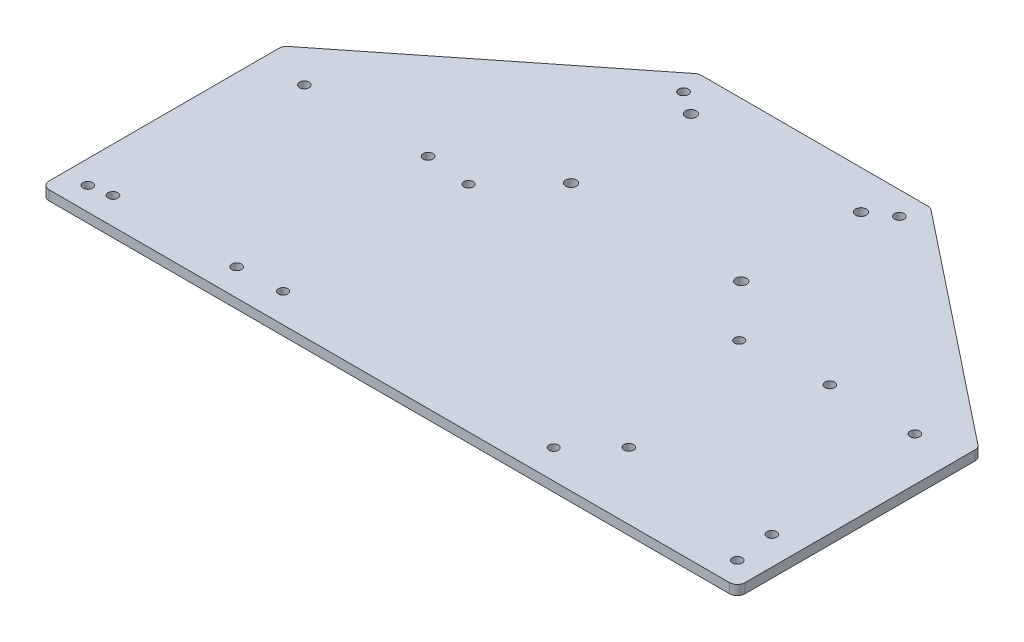
ISO-10303-21;
HEADER;
FILE_DESCRIPTION(('STEP AP214'),'2;1');
FILE_NAME('part.step','',(''),(''),'','','');
FILE_SCHEMA(('AUTOMOTIVE_DESIGN { 1 0 10303 214 1 1 1 1 }'));
ENDSEC;
DATA;
#1=APPLICATION_CONTEXT('core data for automotive mechanical design processes');
#2=APPLICATION_PROTOCOL_DEFINITION('international standard','automotive_design',2000,#1);
#3=PRODUCT_CONTEXT('',#1,'mechanical');
#4=PRODUCT('Part','Part','',(#3));
#5=PRODUCT_RELATED_PRODUCT_CATEGORY('part','',(#4));
#6=PRODUCT_DEFINITION_FORMATION('','',#4);
#7=PRODUCT_DEFINITION_CONTEXT('part definition',#1,'design');
#8=PRODUCT_DEFINITION('design','',#6,#7);
#9=PRODUCT_DEFINITION_SHAPE('','',#8);
#10=(LENGTH_UNIT() NAMED_UNIT(*) SI_UNIT(.MILLI.,.METRE.));
#11=(NAMED_UNIT(*) PLANE_ANGLE_UNIT() SI_UNIT($,.RADIAN.));
#12=(NAMED_UNIT(*) SI_UNIT($,.STERADIAN.) SOLID_ANGLE_UNIT());
#13=UNCERTAINTY_MEASURE_WITH_UNIT(LENGTH_MEASURE(1.E-05),#10,'distance_accuracy_value','');
#14=(GEOMETRIC_REPRESENTATION_CONTEXT(3) GLOBAL_UNCERTAINTY_ASSIGNED_CONTEXT((#13)) GLOBAL_UNIT_ASSIGNED_CONTEXT((#10,
#11,#12)) REPRESENTATION_CONTEXT('',''));
#15=CARTESIAN_POINT('',(0.,0.,0.));
#16=DIRECTION('',(0.,0.,1.));
#17=DIRECTION('',(1.,0.,0.));
#18=AXIS2_PLACEMENT_3D('',#15,#16,#17);
#19=CARTESIAN_POINT('',(0.,3.175,0.));
#20=DIRECTION('',(0.,-1.,0.));
#21=DIRECTION('',(0.,0.,-1.));
#22=AXIS2_PLACEMENT_3D('',#19,#20,#21);
#23=PLANE('',#22);
#24=CARTESIAN_POINT('',(7.62000000000002,3.175,-7.61999999999994));
#25=DIRECTION('',(0.,-1.,0.));
#26=DIRECTION('',(0.,0.,-1.));
#27=AXIS2_PLACEMENT_3D('',#24,#25,#26);
#28=CIRCLE('',#27,1.58749999999999);
#29=CARTESIAN_POINT('',(7.62000000000002,3.175,-9.20749999999993));
#30=VERTEX_POINT('',#29);
#31=EDGE_CURVE('E349',#30,#30,#28,.T.);
#32=ORIENTED_EDGE('',*,*,#31,.T.);
#33=EDGE_LOOP('',(#32));
#34=FACE_BOUND('',#33,.T.);
#35=CARTESIAN_POINT('',(149.744486069191,3.175,-132.08));
#36=DIRECTION('',(0.,1.,0.));
#37=DIRECTION('',(0.,0.,1.));
#38=AXIS2_PLACEMENT_3D('',#35,#36,#37);
#39=CIRCLE('',#38,1.58749999999999);
#40=CARTESIAN_POINT('',(149.744486069191,3.175,-130.4925));
#41=VERTEX_POINT('',#40);
#42=EDGE_CURVE('E344',#41,#41,#39,.T.);
#43=ORIENTED_EDGE('',*,*,#42,.F.);
#44=EDGE_LOOP('',(#43));
#45=FACE_BOUND('',#44,.T.);
#46=CARTESIAN_POINT('',(78.8555139308093,3.175,-132.08));
#47=DIRECTION('',(0.,-1.,0.));
#48=DIRECTION('',(0.,0.,-1.));
#49=AXIS2_PLACEMENT_3D('',#46,#47,#48);
#50=CIRCLE('',#49,1.58749999999999);
#51=CARTESIAN_POINT('',(78.8555139308093,3.175,-133.6675));
#52=VERTEX_POINT('',#51);
#53=EDGE_CURVE('E154',#52,#52,#50,.T.);
#54=ORIENTED_EDGE('',*,*,#53,.T.);
#55=EDGE_LOOP('',(#54));
#56=FACE_BOUND('',#55,.T.);
#57=CARTESIAN_POINT('',(14.605,3.175,-8.89));
#58=DIRECTION('',(0.,1.,0.));
#59=DIRECTION('',(0.,0.,1.));
#60=AXIS2_PLACEMENT_3D('',#57,#58,#59);
#61=CIRCLE('',#60,1.5875);
#62=CARTESIAN_POINT('',(14.605,3.175,-7.3025));
#63=VERTEX_POINT('',#62);
#64=EDGE_CURVE('E171',#63,#63,#61,.T.);
#65=ORIENTED_EDGE('',*,*,#64,.F.);
#66=EDGE_LOOP('',(#65));
#67=FACE_BOUND('',#66,.T.);
#68=CARTESIAN_POINT('',(55.245,3.175,-71.755));
#69=DIRECTION('',(0.,1.,0.));
#70=DIRECTION('',(0.,0.,1.));
#71=AXIS2_PLACEMENT_3D('',#68,#69,#70);
#72=CIRCLE('',#71,1.5875);
#73=CARTESIAN_POINT('',(55.245,3.175,-70.1675));
#74=VERTEX_POINT('',#73);
#75=EDGE_CURVE('E165',#74,#74,#72,.T.);
#76=ORIENTED_EDGE('',*,*,#75,.F.);
#77=EDGE_LOOP('',(#76));
#78=FACE_BOUND('',#77,.T.);
#79=CARTESIAN_POINT('',(55.245,3.175,-8.89));
#80=DIRECTION('',(0.,1.,0.));
#81=DIRECTION('',(0.,0.,1.));
#82=AXIS2_PLACEMENT_3D('',#79,#80,#81);
#83=CIRCLE('',#82,1.5875);
#84=CARTESIAN_POINT('',(55.245,3.175,-7.3025));
#85=VERTEX_POINT('',#84);
#86=EDGE_CURVE('E158',#85,#85,#83,.T.);
#87=ORIENTED_EDGE('',*,*,#86,.F.);
#88=EDGE_LOOP('',(#87));
#89=FACE_BOUND('',#88,.T.);
#90=CARTESIAN_POINT('',(14.605,3.175,-71.755));
#91=DIRECTION('',(0.,1.,0.));
#92=DIRECTION('',(0.,0.,1.));
#93=AXIS2_PLACEMENT_3D('',#90,#91,#92);
#94=CIRCLE('',#93,1.5875);
#95=CARTESIAN_POINT('',(14.605,3.175,-70.1675));
#96=VERTEX_POINT('',#95);
#97=EDGE_CURVE('E161',#96,#96,#94,.T.);
#98=ORIENTED_EDGE('',*,*,#97,.F.);
#99=EDGE_LOOP('',(#98));
#100=FACE_BOUND('',#99,.T.);
#101=CARTESIAN_POINT('',(219.2782,3.175,-20.67814));
#102=DIRECTION('',(0.,1.,0.));
#103=DIRECTION('',(0.,0.,1.));
#104=AXIS2_PLACEMENT_3D('',#101,#102,#103);
#105=CIRCLE('',#104,1.58750000000001);
#106=CARTESIAN_POINT('',(219.2782,3.175,-19.09064));
#107=VERTEX_POINT('',#106);
#108=EDGE_CURVE('E197',#107,#107,#105,.T.);
#109=ORIENTED_EDGE('',*,*,#108,.F.);
#110=EDGE_LOOP('',(#109));
#111=FACE_BOUND('',#110,.T.);
#112=CARTESIAN_POINT('',(171.0182,3.175,-21.94814));
#113=DIRECTION('',(0.,1.,0.));
#114=DIRECTION('',(0.,0.,1.));
#115=AXIS2_PLACEMENT_3D('',#112,#113,#114);
#116=CIRCLE('',#115,1.58749999999999);
#117=CARTESIAN_POINT('',(171.0182,3.175,-20.36064));
#118=VERTEX_POINT('',#117);
#119=EDGE_CURVE('E191',#118,#118,#116,.T.);
#120=ORIENTED_EDGE('',*,*,#119,.F.);
#121=EDGE_LOOP('',(#120));
#122=FACE_BOUND('',#121,.T.);
#123=CARTESIAN_POINT('',(214.1982,3.175,-72.74814));
#124=DIRECTION('',(0.,1.,0.));
#125=DIRECTION('',(0.,0.,1.));
#126=AXIS2_PLACEMENT_3D('',#123,#124,#125);
#127=CIRCLE('',#126,1.58749999999999);
#128=CARTESIAN_POINT('',(214.1982,3.175,-71.16064));
#129=VERTEX_POINT('',#128);
#130=EDGE_CURVE('E184',#129,#129,#127,.T.);
#131=ORIENTED_EDGE('',*,*,#130,.F.);
#132=EDGE_LOOP('',(#131));
#133=FACE_BOUND('',#132,.T.);
#134=CARTESIAN_POINT('',(186.2582,3.175,-72.74814));
#135=DIRECTION('',(0.,1.,0.));
#136=DIRECTION('',(0.,0.,1.));
#137=AXIS2_PLACEMENT_3D('',#134,#135,#136);
#138=CIRCLE('',#137,1.58749999999999);
#139=CARTESIAN_POINT('',(186.2582,3.175,-71.16064));
#140=VERTEX_POINT('',#139);
#141=EDGE_CURVE('E187',#140,#140,#138,.T.);
#142=ORIENTED_EDGE('',*,*,#141,.F.);
#143=EDGE_LOOP('',(#142));
#144=FACE_BOUND('',#143,.T.);
#145=CARTESIAN_POINT('',(69.85,3.175,-9.525));
#146=DIRECTION('',(0.,1.,0.));
#147=DIRECTION('',(0.,0.,1.));
#148=AXIS2_PLACEMENT_3D('',#145,#146,#147);
#149=CIRCLE('',#148,1.52399999999999);
#150=CARTESIAN_POINT('',(69.85,3.175,-8.00100000000001));
#151=VERTEX_POINT('',#150);
#152=EDGE_CURVE('E221',#151,#151,#149,.T.);
#153=ORIENTED_EDGE('',*,*,#152,.F.);
#154=EDGE_LOOP('',(#153));
#155=FACE_BOUND('',#154,.T.);
#156=CARTESIAN_POINT('',(158.75,3.175,-9.525));
#157=DIRECTION('',(0.,1.,0.));
#158=DIRECTION('',(0.,0.,1.));
#159=AXIS2_PLACEMENT_3D('',#156,#157,#158);
#160=CIRCLE('',#159,1.52400000000001);
#161=CARTESIAN_POINT('',(158.75,3.175,-8.00099999999999));
#162=VERTEX_POINT('',#161);
#163=EDGE_CURVE('E215',#162,#162,#160,.T.);
#164=ORIENTED_EDGE('',*,*,#163,.F.);
#165=EDGE_LOOP('',(#164));
#166=FACE_BOUND('',#165,.T.);
#167=CARTESIAN_POINT('',(158.75,3.175,-70.485));
#168=DIRECTION('',(0.,1.,0.));
#169=DIRECTION('',(0.,0.,1.));
#170=AXIS2_PLACEMENT_3D('',#167,#168,#169);
#171=CIRCLE('',#170,1.52400000000001);
#172=CARTESIAN_POINT('',(158.75,3.175,-68.961));
#173=VERTEX_POINT('',#172);
#174=EDGE_CURVE('E208',#173,#173,#171,.T.);
#175=ORIENTED_EDGE('',*,*,#174,.F.);
#176=EDGE_LOOP('',(#175));
#177=FACE_BOUND('',#176,.T.);
#178=CARTESIAN_POINT('',(69.85,3.175,-70.485));
#179=DIRECTION('',(0.,1.,0.));
#180=DIRECTION('',(0.,0.,1.));
#181=AXIS2_PLACEMENT_3D('',#178,#179,#180);
#182=CIRCLE('',#181,1.52399999999999);
#183=CARTESIAN_POINT('',(69.85,3.175,-68.961));
#184=VERTEX_POINT('',#183);
#185=EDGE_CURVE('E211',#184,#184,#182,.T.);
#186=ORIENTED_EDGE('',*,*,#185,.F.);
#187=EDGE_LOOP('',(#186));
#188=FACE_BOUND('',#187,.T.);
#189=DIRECTION('',(0.783409990366249,0.,-0.621505259023891));
#190=VECTOR('',#189,1.);
#191=CARTESIAN_POINT('',(0.,3.175,-79.248));
#192=LINE('',#191,#190);
#193=CARTESIAN_POINT('',(0.961376642079324,3.175,-80.0106921360496));
#194=VERTEX_POINT('',#193);
#195=CARTESIAN_POINT('',(75.5065479523491,3.175,-139.14986137553));
#196=VERTEX_POINT('',#195);
#197=EDGE_CURVE('E141',#194,#196,#192,.T.);
#198=ORIENTED_EDGE('',*,*,#197,.F.);
#199=CARTESIAN_POINT('',(2.54,3.175,-78.0208307605193));
#200=DIRECTION('',(0.,-1.,0.));
#201=DIRECTION('',(0.,0.,-1.));
#202=AXIS2_PLACEMENT_3D('',#199,#200,#201);
#203=CIRCLE('',#202,2.54);
#204=CARTESIAN_POINT('',(0.,3.175,-78.0208307605193));
#205=VERTEX_POINT('',#204);
#206=EDGE_CURVE('E124',#194,#205,#203,.F.);
#207=ORIENTED_EDGE('',*,*,#206,.T.);
#208=DIRECTION('',(0.,0.,1.));
#209=VECTOR('',#208,1.);
#210=CARTESIAN_POINT('',(0.,3.175,0.));
#211=LINE('',#210,#209);
#212=CARTESIAN_POINT('',(0.,3.175,-2.54));
#213=VERTEX_POINT('',#212);
#214=EDGE_CURVE('E256',#205,#213,#211,.T.);
#215=ORIENTED_EDGE('',*,*,#214,.T.);
#216=CARTESIAN_POINT('',(2.54,3.175,-2.54));
#217=DIRECTION('',(0.,-1.,0.));
#218=DIRECTION('',(0.,0.,-1.));
#219=AXIS2_PLACEMENT_3D('',#216,#217,#218);
#220=CIRCLE('',#219,2.54);
#221=CARTESIAN_POINT('',(2.54,3.175,0.));
#222=VERTEX_POINT('',#221);
#223=EDGE_CURVE('E278',#213,#222,#220,.F.);
#224=ORIENTED_EDGE('',*,*,#223,.T.);
#225=DIRECTION('',(1.,0.,0.));
#226=VECTOR('',#225,1.);
#227=CARTESIAN_POINT('',(0.,3.175,0.));
#228=LINE('',#227,#226);
#229=CARTESIAN_POINT('',(226.06,3.175,0.));
#230=VERTEX_POINT('',#229);
#231=EDGE_CURVE('E258',#222,#230,#228,.T.);
#232=ORIENTED_EDGE('',*,*,#231,.T.);
#233=CARTESIAN_POINT('',(226.06,3.175,-2.54));
#234=DIRECTION('',(0.,-1.,0.));
#235=DIRECTION('',(0.,0.,-1.));
#236=AXIS2_PLACEMENT_3D('',#233,#234,#235);
#237=CIRCLE('',#236,2.54);
#238=CARTESIAN_POINT('',(228.6,3.175,-2.54));
#239=VERTEX_POINT('',#238);
#240=EDGE_CURVE('E144',#230,#239,#237,.F.);
#241=ORIENTED_EDGE('',*,*,#240,.T.);
#242=DIRECTION('',(0.,0.,-1.));
#243=VECTOR('',#242,1.);
#244=CARTESIAN_POINT('',(228.6,3.175,0.));
#245=LINE('',#244,#243);
#246=CARTESIAN_POINT('',(228.6,3.175,-78.0208307605193));
#247=VERTEX_POINT('',#246);
#248=EDGE_CURVE('E262',#239,#247,#245,.T.);
#249=ORIENTED_EDGE('',*,*,#248,.T.);
#250=CARTESIAN_POINT('',(226.06,3.175,-78.0208307605193));
#251=DIRECTION('',(0.,-1.,0.));
#252=DIRECTION('',(0.,0.,-1.));
#253=AXIS2_PLACEMENT_3D('',#250,#251,#252);
#254=CIRCLE('',#253,2.54);
#255=CARTESIAN_POINT('',(227.638623357921,3.175,-80.0106921360496));
#256=VERTEX_POINT('',#255);
#257=EDGE_CURVE('E280',#247,#256,#254,.F.);
#258=ORIENTED_EDGE('',*,*,#257,.T.);
#259=DIRECTION('',(0.783409990366249,0.,0.621505259023891));
#260=VECTOR('',#259,1.);
#261=CARTESIAN_POINT('',(228.6,3.175,-79.248));
#262=LINE('',#261,#260);
#263=CARTESIAN_POINT('',(153.093452047651,3.175,-139.14986137553));
#264=VERTEX_POINT('',#263);
#265=EDGE_CURVE('E151',#264,#256,#262,.T.);
#266=ORIENTED_EDGE('',*,*,#265,.F.);
#267=CARTESIAN_POINT('',(151.51482868973,3.175,-137.16));
#268=DIRECTION('',(0.,-1.,0.));
#269=DIRECTION('',(0.,0.,-1.));
#270=AXIS2_PLACEMENT_3D('',#267,#268,#269);
#271=CIRCLE('',#270,2.54);
#272=CARTESIAN_POINT('',(151.51482868973,3.175,-139.7));
#273=VERTEX_POINT('',#272);
#274=EDGE_CURVE('E282',#264,#273,#271,.F.);
#275=ORIENTED_EDGE('',*,*,#274,.T.);
#276=DIRECTION('',(-1.,0.,0.));
#277=VECTOR('',#276,1.);
#278=CARTESIAN_POINT('',(0.,3.175,-139.7));
#279=LINE('',#278,#277);
#280=CARTESIAN_POINT('',(77.0851713102698,3.175,-139.7));
#281=VERTEX_POINT('',#280);
#282=EDGE_CURVE('E265',#273,#281,#279,.T.);
#283=ORIENTED_EDGE('',*,*,#282,.T.);
#284=CARTESIAN_POINT('',(77.0851713102698,3.175,-137.16));
#285=DIRECTION('',(0.,-1.,0.));
#286=DIRECTION('',(0.,0.,-1.));
#287=AXIS2_PLACEMENT_3D('',#284,#285,#286);
#288=CIRCLE('',#287,2.54);
#289=EDGE_CURVE('E135',#281,#196,#288,.F.);
#290=ORIENTED_EDGE('',*,*,#289,.T.);
#291=EDGE_LOOP('',(#198,#207,#215,#224,#232,#241,#249,#258,#266,#275,#283,#290));
#292=FACE_BOUND('',#291,.T.);
#293=CARTESIAN_POINT('',(86.36,3.175,-127.));
#294=DIRECTION('',(0.,1.,0.));
#295=DIRECTION('',(0.,0.,1.));
#296=AXIS2_PLACEMENT_3D('',#293,#294,#295);
#297=CIRCLE('',#296,1.778);
#298=CARTESIAN_POINT('',(86.36,3.175,-125.222));
#299=VERTEX_POINT('',#298);
#300=EDGE_CURVE('E250',#299,#299,#297,.T.);
#301=ORIENTED_EDGE('',*,*,#300,.F.);
#302=EDGE_LOOP('',(#301));
#303=FACE_BOUND('',#302,.T.);
#304=CARTESIAN_POINT('',(142.24,3.175,-127.));
#305=DIRECTION('',(0.,1.,0.));
#306=DIRECTION('',(0.,0.,1.));
#307=AXIS2_PLACEMENT_3D('',#304,#305,#306);
#308=CIRCLE('',#307,1.778);
#309=CARTESIAN_POINT('',(142.24,3.175,-125.222));
#310=VERTEX_POINT('',#309);
#311=EDGE_CURVE('E244',#310,#310,#308,.T.);
#312=ORIENTED_EDGE('',*,*,#311,.F.);
#313=EDGE_LOOP('',(#312));
#314=FACE_BOUND('',#313,.T.);
#315=CARTESIAN_POINT('',(86.36,3.175,-87.63));
#316=DIRECTION('',(0.,1.,0.));
#317=DIRECTION('',(0.,0.,1.));
#318=AXIS2_PLACEMENT_3D('',#315,#316,#317);
#319=CIRCLE('',#318,1.778);
#320=CARTESIAN_POINT('',(86.36,3.175,-85.852));
#321=VERTEX_POINT('',#320);
#322=EDGE_CURVE('E238',#321,#321,#319,.T.);
#323=ORIENTED_EDGE('',*,*,#322,.F.);
#324=EDGE_LOOP('',(#323));
#325=FACE_BOUND('',#324,.T.);
#326=CARTESIAN_POINT('',(142.24,3.175,-87.63));
#327=DIRECTION('',(0.,1.,0.));
#328=DIRECTION('',(0.,0.,1.));
#329=AXIS2_PLACEMENT_3D('',#326,#327,#328);
#330=CIRCLE('',#329,1.778);
#331=CARTESIAN_POINT('',(142.24,3.175,-85.852));
#332=VERTEX_POINT('',#331);
#333=EDGE_CURVE('E232',#332,#332,#330,.T.);
#334=ORIENTED_EDGE('',*,*,#333,.F.);
#335=EDGE_LOOP('',(#334));
#336=FACE_BOUND('',#335,.T.);
#337=CARTESIAN_POINT('',(220.98,3.175,-7.62));
#338=DIRECTION('',(0.,1.,0.));
#339=DIRECTION('',(0.,0.,1.));
#340=AXIS2_PLACEMENT_3D('',#337,#338,#339);
#341=CIRCLE('',#340,1.58749999999999);
#342=CARTESIAN_POINT('',(220.98,3.175,-6.03250000000001));
#343=VERTEX_POINT('',#342);
#344=EDGE_CURVE('E355',#343,#343,#341,.T.);
#345=ORIENTED_EDGE('',*,*,#344,.F.);
#346=EDGE_LOOP('',(#345));
#347=FACE_BOUND('',#346,.T.);
#348=ADVANCED_FACE('F33',(#34,#45,#56,#67,#78,#89,#100,#111,#122,#133,#144,#155,#166,#177,#188,
#292,#303,#314,#325,#336,#347),#23,.F.);
#349=CARTESIAN_POINT('',(0.,0.,0.));
#350=DIRECTION('',(0.,-1.,0.));
#351=DIRECTION('',(0.,0.,-1.));
#352=AXIS2_PLACEMENT_3D('',#349,#350,#351);
#353=PLANE('',#352);
#354=CARTESIAN_POINT('',(7.62000000000002,0.,-7.61999999999994));
#355=DIRECTION('',(0.,-1.,0.));
#356=DIRECTION('',(0.,0.,-1.));
#357=AXIS2_PLACEMENT_3D('',#354,#355,#356);
#358=CIRCLE('',#357,1.58749999999999);
#359=CARTESIAN_POINT('',(7.62000000000002,0.,-9.20749999999993));
#360=VERTEX_POINT('',#359);
#361=EDGE_CURVE('E346',#360,#360,#358,.T.);
#362=ORIENTED_EDGE('',*,*,#361,.F.);
#363=EDGE_LOOP('',(#362));
#364=FACE_BOUND('',#363,.T.);
#365=CARTESIAN_POINT('',(78.8555139308093,0.,-132.08));
#366=DIRECTION('',(0.,-1.,0.));
#367=DIRECTION('',(0.,0.,-1.));
#368=AXIS2_PLACEMENT_3D('',#365,#366,#367);
#369=CIRCLE('',#368,1.58749999999999);
#370=CARTESIAN_POINT('',(78.8555139308093,0.,-133.6675));
#371=VERTEX_POINT('',#370);
#372=EDGE_CURVE('E149',#371,#371,#369,.T.);
#373=ORIENTED_EDGE('',*,*,#372,.F.);
#374=EDGE_LOOP('',(#373));
#375=FACE_BOUND('',#374,.T.);
#376=DIRECTION('',(0.,0.,1.));
#377=VECTOR('',#376,1.);
#378=CARTESIAN_POINT('',(0.,0.,0.));
#379=LINE('',#378,#377);
#380=CARTESIAN_POINT('',(0.,0.,-78.0208307605193));
#381=VERTEX_POINT('',#380);
#382=CARTESIAN_POINT('',(0.,0.,-2.54));
#383=VERTEX_POINT('',#382);
#384=EDGE_CURVE('E253',#381,#383,#379,.T.);
#385=ORIENTED_EDGE('',*,*,#384,.F.);
#386=CARTESIAN_POINT('',(2.54,0.,-78.0208307605193));
#387=DIRECTION('',(0.,-1.,0.));
#388=DIRECTION('',(0.,0.,-1.));
#389=AXIS2_PLACEMENT_3D('',#386,#387,#388);
#390=CIRCLE('',#389,2.54);
#391=CARTESIAN_POINT('',(0.961376642079324,0.,-80.0106921360496));
#392=VERTEX_POINT('',#391);
#393=EDGE_CURVE('E296',#381,#392,#390,.T.);
#394=ORIENTED_EDGE('',*,*,#393,.T.);
#395=DIRECTION('',(0.783409990366249,0.,-0.621505259023891));
#396=VECTOR('',#395,1.);
#397=CARTESIAN_POINT('',(0.,0.,-79.248));
#398=LINE('',#397,#396);
#399=CARTESIAN_POINT('',(75.5065479523491,0.,-139.14986137553));
#400=VERTEX_POINT('',#399);
#401=EDGE_CURVE('E143',#392,#400,#398,.T.);
#402=ORIENTED_EDGE('',*,*,#401,.T.);
#403=CARTESIAN_POINT('',(77.0851713102698,0.,-137.16));
#404=DIRECTION('',(0.,-1.,0.));
#405=DIRECTION('',(0.,0.,-1.));
#406=AXIS2_PLACEMENT_3D('',#403,#404,#405);
#407=CIRCLE('',#406,2.54);
#408=CARTESIAN_POINT('',(77.0851713102698,0.,-139.7));
#409=VERTEX_POINT('',#408);
#410=EDGE_CURVE('E48',#400,#409,#407,.T.);
#411=ORIENTED_EDGE('',*,*,#410,.T.);
#412=DIRECTION('',(-1.,0.,0.));
#413=VECTOR('',#412,1.);
#414=CARTESIAN_POINT('',(0.,0.,-139.7));
#415=LINE('',#414,#413);
#416=CARTESIAN_POINT('',(151.51482868973,0.,-139.7));
#417=VERTEX_POINT('',#416);
#418=EDGE_CURVE('E259',#417,#409,#415,.T.);
#419=ORIENTED_EDGE('',*,*,#418,.F.);
#420=CARTESIAN_POINT('',(151.51482868973,0.,-137.16));
#421=DIRECTION('',(0.,-1.,0.));
#422=DIRECTION('',(0.,0.,-1.));
#423=AXIS2_PLACEMENT_3D('',#420,#421,#422);
#424=CIRCLE('',#423,2.54);
#425=CARTESIAN_POINT('',(153.093452047651,0.,-139.14986137553));
#426=VERTEX_POINT('',#425);
#427=EDGE_CURVE('E293',#417,#426,#424,.T.);
#428=ORIENTED_EDGE('',*,*,#427,.T.);
#429=DIRECTION('',(0.783409990366249,0.,0.621505259023891));
#430=VECTOR('',#429,1.);
#431=CARTESIAN_POINT('',(228.6,0.,-79.248));
#432=LINE('',#431,#430);
#433=CARTESIAN_POINT('',(227.638623357921,0.,-80.0106921360496));
#434=VERTEX_POINT('',#433);
#435=EDGE_CURVE('E177',#426,#434,#432,.T.);
#436=ORIENTED_EDGE('',*,*,#435,.T.);
#437=CARTESIAN_POINT('',(226.06,0.,-78.0208307605193));
#438=DIRECTION('',(0.,-1.,0.));
#439=DIRECTION('',(0.,0.,-1.));
#440=AXIS2_PLACEMENT_3D('',#437,#438,#439);
#441=CIRCLE('',#440,2.54);
#442=CARTESIAN_POINT('',(228.6,0.,-78.0208307605193));
#443=VERTEX_POINT('',#442);
#444=EDGE_CURVE('E291',#434,#443,#441,.T.);
#445=ORIENTED_EDGE('',*,*,#444,.T.);
#446=DIRECTION('',(0.,0.,-1.));
#447=VECTOR('',#446,1.);
#448=CARTESIAN_POINT('',(228.6,0.,0.));
#449=LINE('',#448,#447);
#450=CARTESIAN_POINT('',(228.6,0.,-2.54));
#451=VERTEX_POINT('',#450);
#452=EDGE_CURVE('E272',#451,#443,#449,.T.);
#453=ORIENTED_EDGE('',*,*,#452,.F.);
#454=CARTESIAN_POINT('',(226.06,0.,-2.54));
#455=DIRECTION('',(0.,-1.,0.));
#456=DIRECTION('',(0.,0.,-1.));
#457=AXIS2_PLACEMENT_3D('',#454,#455,#456);
#458=CIRCLE('',#457,2.54);
#459=CARTESIAN_POINT('',(226.06,0.,0.));
#460=VERTEX_POINT('',#459);
#461=EDGE_CURVE('E287',#451,#460,#458,.T.);
#462=ORIENTED_EDGE('',*,*,#461,.T.);
#463=DIRECTION('',(1.,0.,0.));
#464=VECTOR('',#463,1.);
#465=CARTESIAN_POINT('',(0.,0.,0.));
#466=LINE('',#465,#464);
#467=CARTESIAN_POINT('',(2.54,0.,0.));
#468=VERTEX_POINT('',#467);
#469=EDGE_CURVE('E269',#468,#460,#466,.T.);
#470=ORIENTED_EDGE('',*,*,#469,.F.);
#471=CARTESIAN_POINT('',(2.54,0.,-2.54));
#472=DIRECTION('',(0.,-1.,0.));
#473=DIRECTION('',(0.,0.,-1.));
#474=AXIS2_PLACEMENT_3D('',#471,#472,#473);
#475=CIRCLE('',#474,2.54);
#476=EDGE_CURVE('E289',#468,#383,#475,.T.);
#477=ORIENTED_EDGE('',*,*,#476,.T.);
#478=EDGE_LOOP('',(#385,#394,#402,#411,#419,#428,#436,#445,#453,#462,#470,#477));
#479=FACE_BOUND('',#478,.T.);
#480=CARTESIAN_POINT('',(14.605,0.,-8.89));
#481=DIRECTION('',(0.,1.,0.));
#482=DIRECTION('',(0.,0.,1.));
#483=AXIS2_PLACEMENT_3D('',#480,#481,#482);
#484=CIRCLE('',#483,1.5875);
#485=CARTESIAN_POINT('',(14.605,0.,-7.3025));
#486=VERTEX_POINT('',#485);
#487=EDGE_CURVE('E174',#486,#486,#484,.T.);
#488=ORIENTED_EDGE('',*,*,#487,.T.);
#489=EDGE_LOOP('',(#488));
#490=FACE_BOUND('',#489,.T.);
#491=CARTESIAN_POINT('',(55.245,0.,-71.755));
#492=DIRECTION('',(0.,1.,0.));
#493=DIRECTION('',(0.,0.,1.));
#494=AXIS2_PLACEMENT_3D('',#491,#492,#493);
#495=CIRCLE('',#494,1.5875);
#496=CARTESIAN_POINT('',(55.245,0.,-70.1675));
#497=VERTEX_POINT('',#496);
#498=EDGE_CURVE('E168',#497,#497,#495,.T.);
#499=ORIENTED_EDGE('',*,*,#498,.T.);
#500=EDGE_LOOP('',(#499));
#501=FACE_BOUND('',#500,.T.);
#502=CARTESIAN_POINT('',(55.245,0.,-8.89));
#503=DIRECTION('',(0.,1.,0.));
#504=DIRECTION('',(0.,0.,1.));
#505=AXIS2_PLACEMENT_3D('',#502,#503,#504);
#506=CIRCLE('',#505,1.5875);
#507=CARTESIAN_POINT('',(55.245,0.,-7.3025));
#508=VERTEX_POINT('',#507);
#509=EDGE_CURVE('E162',#508,#508,#506,.T.);
#510=ORIENTED_EDGE('',*,*,#509,.T.);
#511=EDGE_LOOP('',(#510));
#512=FACE_BOUND('',#511,.T.);
#513=CARTESIAN_POINT('',(14.605,0.,-71.755));
#514=DIRECTION('',(0.,1.,0.));
#515=DIRECTION('',(0.,0.,1.));
#516=AXIS2_PLACEMENT_3D('',#513,#514,#515);
#517=CIRCLE('',#516,1.5875);
#518=CARTESIAN_POINT('',(14.605,0.,-70.1675));
#519=VERTEX_POINT('',#518);
#520=EDGE_CURVE('E178',#519,#519,#517,.T.);
#521=ORIENTED_EDGE('',*,*,#520,.T.);
#522=EDGE_LOOP('',(#521));
#523=FACE_BOUND('',#522,.T.);
#524=CARTESIAN_POINT('',(219.2782,0.,-20.67814));
#525=DIRECTION('',(0.,1.,0.));
#526=DIRECTION('',(0.,0.,1.));
#527=AXIS2_PLACEMENT_3D('',#524,#525,#526);
#528=CIRCLE('',#527,1.58750000000001);
#529=CARTESIAN_POINT('',(219.2782,0.,-19.09064));
#530=VERTEX_POINT('',#529);
#531=EDGE_CURVE('E181',#530,#530,#528,.T.);
#532=ORIENTED_EDGE('',*,*,#531,.T.);
#533=EDGE_LOOP('',(#532));
#534=FACE_BOUND('',#533,.T.);
#535=CARTESIAN_POINT('',(171.0182,0.,-21.94814));
#536=DIRECTION('',(0.,1.,0.));
#537=DIRECTION('',(0.,0.,1.));
#538=AXIS2_PLACEMENT_3D('',#535,#536,#537);
#539=CIRCLE('',#538,1.58749999999999);
#540=CARTESIAN_POINT('',(171.0182,0.,-20.36064));
#541=VERTEX_POINT('',#540);
#542=EDGE_CURVE('E194',#541,#541,#539,.T.);
#543=ORIENTED_EDGE('',*,*,#542,.T.);
#544=EDGE_LOOP('',(#543));
#545=FACE_BOUND('',#544,.T.);
#546=CARTESIAN_POINT('',(214.1982,0.,-72.74814));
#547=DIRECTION('',(0.,1.,0.));
#548=DIRECTION('',(0.,0.,1.));
#549=AXIS2_PLACEMENT_3D('',#546,#547,#548);
#550=CIRCLE('',#549,1.58749999999999);
#551=CARTESIAN_POINT('',(214.1982,0.,-71.16064));
#552=VERTEX_POINT('',#551);
#553=EDGE_CURVE('E188',#552,#552,#550,.T.);
#554=ORIENTED_EDGE('',*,*,#553,.T.);
#555=EDGE_LOOP('',(#554));
#556=FACE_BOUND('',#555,.T.);
#557=CARTESIAN_POINT('',(186.2582,0.,-72.74814));
#558=DIRECTION('',(0.,1.,0.));
#559=DIRECTION('',(0.,0.,1.));
#560=AXIS2_PLACEMENT_3D('',#557,#558,#559);
#561=CIRCLE('',#560,1.58749999999999);
#562=CARTESIAN_POINT('',(186.2582,0.,-71.16064));
#563=VERTEX_POINT('',#562);
#564=EDGE_CURVE('E202',#563,#563,#561,.T.);
#565=ORIENTED_EDGE('',*,*,#564,.T.);
#566=EDGE_LOOP('',(#565));
#567=FACE_BOUND('',#566,.T.);
#568=CARTESIAN_POINT('',(69.85,0.,-9.525));
#569=DIRECTION('',(0.,1.,0.));
#570=DIRECTION('',(0.,0.,1.));
#571=AXIS2_PLACEMENT_3D('',#568,#569,#570);
#572=CIRCLE('',#571,1.52399999999999);
#573=CARTESIAN_POINT('',(69.85,0.,-8.00100000000001));
#574=VERTEX_POINT('',#573);
#575=EDGE_CURVE('E205',#574,#574,#572,.T.);
#576=ORIENTED_EDGE('',*,*,#575,.T.);
#577=EDGE_LOOP('',(#576));
#578=FACE_BOUND('',#577,.T.);
#579=CARTESIAN_POINT('',(158.75,0.,-9.525));
#580=DIRECTION('',(0.,1.,0.));
#581=DIRECTION('',(0.,0.,1.));
#582=AXIS2_PLACEMENT_3D('',#579,#580,#581);
#583=CIRCLE('',#582,1.52400000000001);
#584=CARTESIAN_POINT('',(158.75,0.,-8.00099999999999));
#585=VERTEX_POINT('',#584);
#586=EDGE_CURVE('E218',#585,#585,#583,.T.);
#587=ORIENTED_EDGE('',*,*,#586,.T.);
#588=EDGE_LOOP('',(#587));
#589=FACE_BOUND('',#588,.T.);
#590=CARTESIAN_POINT('',(158.75,0.,-70.485));
#591=DIRECTION('',(0.,1.,0.));
#592=DIRECTION('',(0.,0.,1.));
#593=AXIS2_PLACEMENT_3D('',#590,#591,#592);
#594=CIRCLE('',#593,1.52400000000001);
#595=CARTESIAN_POINT('',(158.75,0.,-68.961));
#596=VERTEX_POINT('',#595);
#597=EDGE_CURVE('E212',#596,#596,#594,.T.);
#598=ORIENTED_EDGE('',*,*,#597,.T.);
#599=EDGE_LOOP('',(#598));
#600=FACE_BOUND('',#599,.T.);
#601=CARTESIAN_POINT('',(69.85,0.,-70.485));
#602=DIRECTION('',(0.,1.,0.));
#603=DIRECTION('',(0.,0.,1.));
#604=AXIS2_PLACEMENT_3D('',#601,#602,#603);
#605=CIRCLE('',#604,1.52399999999999);
#606=CARTESIAN_POINT('',(69.85,0.,-68.961));
#607=VERTEX_POINT('',#606);
#608=EDGE_CURVE('E226',#607,#607,#605,.T.);
#609=ORIENTED_EDGE('',*,*,#608,.T.);
#610=EDGE_LOOP('',(#609));
#611=FACE_BOUND('',#610,.T.);
#612=CARTESIAN_POINT('',(86.36,0.,-87.63));
#613=DIRECTION('',(0.,1.,0.));
#614=DIRECTION('',(0.,0.,1.));
#615=AXIS2_PLACEMENT_3D('',#612,#613,#614);
#616=CIRCLE('',#615,1.778);
#617=CARTESIAN_POINT('',(86.36,0.,-85.852));
#618=VERTEX_POINT('',#617);
#619=EDGE_CURVE('E235',#618,#618,#616,.T.);
#620=ORIENTED_EDGE('',*,*,#619,.T.);
#621=EDGE_LOOP('',(#620));
#622=FACE_BOUND('',#621,.T.);
#623=CARTESIAN_POINT('',(86.36,0.,-127.));
#624=DIRECTION('',(0.,1.,0.));
#625=DIRECTION('',(0.,0.,1.));
#626=AXIS2_PLACEMENT_3D('',#623,#624,#625);
#627=CIRCLE('',#626,1.778);
#628=CARTESIAN_POINT('',(86.36,0.,-125.222));
#629=VERTEX_POINT('',#628);
#630=EDGE_CURVE('E247',#629,#629,#627,.T.);
#631=ORIENTED_EDGE('',*,*,#630,.T.);
#632=EDGE_LOOP('',(#631));
#633=FACE_BOUND('',#632,.T.);
#634=CARTESIAN_POINT('',(142.24,0.,-127.));
#635=DIRECTION('',(0.,1.,0.));
#636=DIRECTION('',(0.,0.,1.));
#637=AXIS2_PLACEMENT_3D('',#634,#635,#636);
#638=CIRCLE('',#637,1.778);
#639=CARTESIAN_POINT('',(142.24,0.,-125.222));
#640=VERTEX_POINT('',#639);
#641=EDGE_CURVE('E241',#640,#640,#638,.T.);
#642=ORIENTED_EDGE('',*,*,#641,.T.);
#643=EDGE_LOOP('',(#642));
#644=FACE_BOUND('',#643,.T.);
#645=CARTESIAN_POINT('',(142.24,0.,-87.63));
#646=DIRECTION('',(0.,1.,0.));
#647=DIRECTION('',(0.,0.,1.));
#648=AXIS2_PLACEMENT_3D('',#645,#646,#647);
#649=CIRCLE('',#648,1.778);
#650=CARTESIAN_POINT('',(142.24,0.,-85.852));
#651=VERTEX_POINT('',#650);
#652=EDGE_CURVE('E229',#651,#651,#649,.T.);
#653=ORIENTED_EDGE('',*,*,#652,.T.);
#654=EDGE_LOOP('',(#653));
#655=FACE_BOUND('',#654,.T.);
#656=CARTESIAN_POINT('',(149.744486069191,0.,-132.08));
#657=DIRECTION('',(0.,1.,0.));
#658=DIRECTION('',(0.,0.,1.));
#659=AXIS2_PLACEMENT_3D('',#656,#657,#658);
#660=CIRCLE('',#659,1.58749999999999);
#661=CARTESIAN_POINT('',(149.744486069191,0.,-130.4925));
#662=VERTEX_POINT('',#661);
#663=EDGE_CURVE('E358',#662,#662,#660,.T.);
#664=ORIENTED_EDGE('',*,*,#663,.T.);
#665=EDGE_LOOP('',(#664));
#666=FACE_BOUND('',#665,.T.);
#667=CARTESIAN_POINT('',(220.98,0.,-7.62));
#668=DIRECTION('',(0.,1.,0.));
#669=DIRECTION('',(0.,0.,1.));
#670=AXIS2_PLACEMENT_3D('',#667,#668,#669);
#671=CIRCLE('',#670,1.58749999999999);
#672=CARTESIAN_POINT('',(220.98,0.,-6.03250000000001));
#673=VERTEX_POINT('',#672);
#674=EDGE_CURVE('E352',#673,#673,#671,.T.);
#675=ORIENTED_EDGE('',*,*,#674,.T.);
#676=EDGE_LOOP('',(#675));
#677=FACE_BOUND('',#676,.T.);
#678=ADVANCED_FACE('F328',(#364,#375,#479,#490,#501,#512,#523,#534,#545,#556,#567,#578,#589,
#600,#611,#622,#633,#644,#655,#666,#677),#353,.T.);
#679=CARTESIAN_POINT('',(0.,3.175,0.));
#680=DIRECTION('',(1.,0.,0.));
#681=DIRECTION('',(0.,0.,-1.));
#682=AXIS2_PLACEMENT_3D('',#679,#680,#681);
#683=PLANE('',#682);
#684=ORIENTED_EDGE('',*,*,#214,.F.);
#685=DIRECTION('',(0.,1.,0.));
#686=VECTOR('',#685,1.);
#687=CARTESIAN_POINT('',(0.,3.175,-78.0208307605193));
#688=LINE('',#687,#686);
#689=EDGE_CURVE('E129',#205,#381,#688,.F.);
#690=ORIENTED_EDGE('',*,*,#689,.T.);
#691=ORIENTED_EDGE('',*,*,#384,.T.);
#692=DIRECTION('',(0.,-1.,0.));
#693=VECTOR('',#692,1.);
#694=CARTESIAN_POINT('',(0.,3.175,-2.54));
#695=LINE('',#694,#693);
#696=EDGE_CURVE('E134',#383,#213,#695,.F.);
#697=ORIENTED_EDGE('',*,*,#696,.T.);
#698=EDGE_LOOP('',(#684,#690,#691,#697));
#699=FACE_BOUND('',#698,.T.);
#700=ADVANCED_FACE('F431',(#699),#683,.F.);
#701=CARTESIAN_POINT('',(0.,3.175,0.));
#702=DIRECTION('',(0.,0.,-1.));
#703=DIRECTION('',(-1.,0.,0.));
#704=AXIS2_PLACEMENT_3D('',#701,#702,#703);
#705=PLANE('',#704);
#706=ORIENTED_EDGE('',*,*,#231,.F.);
#707=DIRECTION('',(0.,-1.,0.));
#708=VECTOR('',#707,1.);
#709=CARTESIAN_POINT('',(2.54,3.175,0.));
#710=LINE('',#709,#708);
#711=EDGE_CURVE('E11',#222,#468,#710,.T.);
#712=ORIENTED_EDGE('',*,*,#711,.T.);
#713=ORIENTED_EDGE('',*,*,#469,.T.);
#714=DIRECTION('',(0.,-1.,0.));
#715=VECTOR('',#714,1.);
#716=CARTESIAN_POINT('',(226.06,3.175,0.));
#717=LINE('',#716,#715);
#718=EDGE_CURVE('E41',#460,#230,#717,.F.);
#719=ORIENTED_EDGE('',*,*,#718,.T.);
#720=EDGE_LOOP('',(#706,#712,#713,#719));
#721=FACE_BOUND('',#720,.T.);
#722=ADVANCED_FACE('F315',(#721),#705,.F.);
#723=CARTESIAN_POINT('',(228.6,3.175,0.));
#724=DIRECTION('',(-1.,0.,0.));
#725=DIRECTION('',(0.,0.,1.));
#726=AXIS2_PLACEMENT_3D('',#723,#724,#725);
#727=PLANE('',#726);
#728=ORIENTED_EDGE('',*,*,#452,.T.);
#729=DIRECTION('',(0.,1.,0.));
#730=VECTOR('',#729,1.);
#731=CARTESIAN_POINT('',(228.6,3.175,-78.0208307605193));
#732=LINE('',#731,#730);
#733=EDGE_CURVE('E310',#443,#247,#732,.T.);
#734=ORIENTED_EDGE('',*,*,#733,.T.);
#735=ORIENTED_EDGE('',*,*,#248,.F.);
#736=DIRECTION('',(0.,-1.,0.));
#737=VECTOR('',#736,1.);
#738=CARTESIAN_POINT('',(228.6,3.175,-2.54));
#739=LINE('',#738,#737);
#740=EDGE_CURVE('E307',#239,#451,#739,.T.);
#741=ORIENTED_EDGE('',*,*,#740,.T.);
#742=EDGE_LOOP('',(#728,#734,#735,#741));
#743=FACE_BOUND('',#742,.T.);
#744=ADVANCED_FACE('F325',(#743),#727,.F.);
#745=CARTESIAN_POINT('',(0.,3.175,-139.7));
#746=DIRECTION('',(0.,0.,1.));
#747=DIRECTION('',(1.,0.,0.));
#748=AXIS2_PLACEMENT_3D('',#745,#746,#747);
#749=PLANE('',#748);
#750=ORIENTED_EDGE('',*,*,#418,.T.);
#751=DIRECTION('',(0.,1.,0.));
#752=VECTOR('',#751,1.);
#753=CARTESIAN_POINT('',(77.0851713102698,3.175,-139.7));
#754=LINE('',#753,#752);
#755=EDGE_CURVE('E299',#409,#281,#754,.T.);
#756=ORIENTED_EDGE('',*,*,#755,.T.);
#757=ORIENTED_EDGE('',*,*,#282,.F.);
#758=DIRECTION('',(0.,1.,0.));
#759=VECTOR('',#758,1.);
#760=CARTESIAN_POINT('',(151.51482868973,3.175,-139.7));
#761=LINE('',#760,#759);
#762=EDGE_CURVE('E55',#273,#417,#761,.F.);
#763=ORIENTED_EDGE('',*,*,#762,.T.);
#764=EDGE_LOOP('',(#750,#756,#757,#763));
#765=FACE_BOUND('',#764,.T.);
#766=ADVANCED_FACE('F426',(#765),#749,.F.);
#767=CARTESIAN_POINT('',(86.36,3.175,-127.));
#768=DIRECTION('',(0.,-1.,0.));
#769=DIRECTION('',(0.,0.,-1.));
#770=AXIS2_PLACEMENT_3D('',#767,#768,#769);
#771=CYLINDRICAL_SURFACE('',#770,1.778);
#772=ORIENTED_EDGE('',*,*,#300,.T.);
#773=EDGE_LOOP('',(#772));
#774=FACE_BOUND('',#773,.T.);
#775=ORIENTED_EDGE('',*,*,#630,.F.);
#776=EDGE_LOOP('',(#775));
#777=FACE_BOUND('',#776,.T.);
#778=ADVANCED_FACE('F423',(#774,#777),#771,.F.);
#779=CARTESIAN_POINT('',(142.24,3.175,-127.));
#780=DIRECTION('',(0.,-1.,0.));
#781=DIRECTION('',(0.,0.,-1.));
#782=AXIS2_PLACEMENT_3D('',#779,#780,#781);
#783=CYLINDRICAL_SURFACE('',#782,1.778);
#784=ORIENTED_EDGE('',*,*,#311,.T.);
#785=EDGE_LOOP('',(#784));
#786=FACE_BOUND('',#785,.T.);
#787=ORIENTED_EDGE('',*,*,#641,.F.);
#788=EDGE_LOOP('',(#787));
#789=FACE_BOUND('',#788,.T.);
#790=ADVANCED_FACE('F419',(#786,#789),#783,.F.);
#791=CARTESIAN_POINT('',(86.36,3.175,-87.63));
#792=DIRECTION('',(0.,-1.,0.));
#793=DIRECTION('',(0.,0.,-1.));
#794=AXIS2_PLACEMENT_3D('',#791,#792,#793);
#795=CYLINDRICAL_SURFACE('',#794,1.778);
#796=ORIENTED_EDGE('',*,*,#322,.T.);
#797=EDGE_LOOP('',(#796));
#798=FACE_BOUND('',#797,.T.);
#799=ORIENTED_EDGE('',*,*,#619,.F.);
#800=EDGE_LOOP('',(#799));
#801=FACE_BOUND('',#800,.T.);
#802=ADVANCED_FACE('F409',(#798,#801),#795,.F.);
#803=CARTESIAN_POINT('',(142.24,3.175,-87.63));
#804=DIRECTION('',(0.,-1.,0.));
#805=DIRECTION('',(0.,0.,-1.));
#806=AXIS2_PLACEMENT_3D('',#803,#804,#805);
#807=CYLINDRICAL_SURFACE('',#806,1.778);
#808=ORIENTED_EDGE('',*,*,#333,.T.);
#809=EDGE_LOOP('',(#808));
#810=FACE_BOUND('',#809,.T.);
#811=ORIENTED_EDGE('',*,*,#652,.F.);
#812=EDGE_LOOP('',(#811));
#813=FACE_BOUND('',#812,.T.);
#814=ADVANCED_FACE('F399',(#810,#813),#807,.F.);
#815=CARTESIAN_POINT('',(69.85,0.,-70.485));
#816=DIRECTION('',(0.,1.,0.));
#817=DIRECTION('',(0.,0.,1.));
#818=AXIS2_PLACEMENT_3D('',#815,#816,#817);
#819=CYLINDRICAL_SURFACE('',#818,1.52399999999999);
#820=ORIENTED_EDGE('',*,*,#608,.F.);
#821=EDGE_LOOP('',(#820));
#822=FACE_BOUND('',#821,.T.);
#823=ORIENTED_EDGE('',*,*,#185,.T.);
#824=EDGE_LOOP('',(#823));
#825=FACE_BOUND('',#824,.T.);
#826=ADVANCED_FACE('F396',(#822,#825),#819,.F.);
#827=CARTESIAN_POINT('',(158.75,0.,-70.485));
#828=DIRECTION('',(0.,1.,0.));
#829=DIRECTION('',(0.,0.,1.));
#830=AXIS2_PLACEMENT_3D('',#827,#828,#829);
#831=CYLINDRICAL_SURFACE('',#830,1.52400000000001);
#832=ORIENTED_EDGE('',*,*,#597,.F.);
#833=EDGE_LOOP('',(#832));
#834=FACE_BOUND('',#833,.T.);
#835=ORIENTED_EDGE('',*,*,#174,.T.);
#836=EDGE_LOOP('',(#835));
#837=FACE_BOUND('',#836,.T.);
#838=ADVANCED_FACE('F398',(#834,#837),#831,.F.);
#839=CARTESIAN_POINT('',(158.75,0.,-9.525));
#840=DIRECTION('',(0.,1.,0.));
#841=DIRECTION('',(0.,0.,1.));
#842=AXIS2_PLACEMENT_3D('',#839,#840,#841);
#843=CYLINDRICAL_SURFACE('',#842,1.52400000000001);
#844=ORIENTED_EDGE('',*,*,#586,.F.);
#845=EDGE_LOOP('',(#844));
#846=FACE_BOUND('',#845,.T.);
#847=ORIENTED_EDGE('',*,*,#163,.T.);
#848=EDGE_LOOP('',(#847));
#849=FACE_BOUND('',#848,.T.);
#850=ADVANCED_FACE('F406',(#846,#849),#843,.F.);
#851=CARTESIAN_POINT('',(69.85,0.,-9.525));
#852=DIRECTION('',(0.,1.,0.));
#853=DIRECTION('',(0.,0.,1.));
#854=AXIS2_PLACEMENT_3D('',#851,#852,#853);
#855=CYLINDRICAL_SURFACE('',#854,1.52399999999999);
#856=ORIENTED_EDGE('',*,*,#575,.F.);
#857=EDGE_LOOP('',(#856));
#858=FACE_BOUND('',#857,.T.);
#859=ORIENTED_EDGE('',*,*,#152,.T.);
#860=EDGE_LOOP('',(#859));
#861=FACE_BOUND('',#860,.T.);
#862=ADVANCED_FACE('F414',(#858,#861),#855,.F.);
#863=CARTESIAN_POINT('',(186.2582,0.,-72.74814));
#864=DIRECTION('',(0.,1.,0.));
#865=DIRECTION('',(0.,0.,1.));
#866=AXIS2_PLACEMENT_3D('',#863,#864,#865);
#867=CYLINDRICAL_SURFACE('',#866,1.58749999999999);
#868=ORIENTED_EDGE('',*,*,#564,.F.);
#869=EDGE_LOOP('',(#868));
#870=FACE_BOUND('',#869,.T.);
#871=ORIENTED_EDGE('',*,*,#141,.T.);
#872=EDGE_LOOP('',(#871));
#873=FACE_BOUND('',#872,.T.);
#874=ADVANCED_FACE('F506',(#870,#873),#867,.F.);
#875=CARTESIAN_POINT('',(214.1982,0.,-72.74814));
#876=DIRECTION('',(0.,1.,0.));
#877=DIRECTION('',(0.,0.,1.));
#878=AXIS2_PLACEMENT_3D('',#875,#876,#877);
#879=CYLINDRICAL_SURFACE('',#878,1.58749999999999);
#880=ORIENTED_EDGE('',*,*,#553,.F.);
#881=EDGE_LOOP('',(#880));
#882=FACE_BOUND('',#881,.T.);
#883=ORIENTED_EDGE('',*,*,#130,.T.);
#884=EDGE_LOOP('',(#883));
#885=FACE_BOUND('',#884,.T.);
#886=ADVANCED_FACE('F502',(#882,#885),#879,.F.);
#887=CARTESIAN_POINT('',(171.0182,0.,-21.94814));
#888=DIRECTION('',(0.,1.,0.));
#889=DIRECTION('',(0.,0.,1.));
#890=AXIS2_PLACEMENT_3D('',#887,#888,#889);
#891=CYLINDRICAL_SURFACE('',#890,1.58749999999999);
#892=ORIENTED_EDGE('',*,*,#542,.F.);
#893=EDGE_LOOP('',(#892));
#894=FACE_BOUND('',#893,.T.);
#895=ORIENTED_EDGE('',*,*,#119,.T.);
#896=EDGE_LOOP('',(#895));
#897=FACE_BOUND('',#896,.T.);
#898=ADVANCED_FACE('F505',(#894,#897),#891,.F.);
#899=CARTESIAN_POINT('',(219.2782,0.,-20.67814));
#900=DIRECTION('',(0.,1.,0.));
#901=DIRECTION('',(0.,0.,1.));
#902=AXIS2_PLACEMENT_3D('',#899,#900,#901);
#903=CYLINDRICAL_SURFACE('',#902,1.58750000000001);
#904=ORIENTED_EDGE('',*,*,#531,.F.);
#905=EDGE_LOOP('',(#904));
#906=FACE_BOUND('',#905,.T.);
#907=ORIENTED_EDGE('',*,*,#108,.T.);
#908=EDGE_LOOP('',(#907));
#909=FACE_BOUND('',#908,.T.);
#910=ADVANCED_FACE('F500',(#906,#909),#903,.F.);
#911=CARTESIAN_POINT('',(14.605,0.,-71.755));
#912=DIRECTION('',(0.,1.,0.));
#913=DIRECTION('',(0.,0.,1.));
#914=AXIS2_PLACEMENT_3D('',#911,#912,#913);
#915=CYLINDRICAL_SURFACE('',#914,1.5875);
#916=ORIENTED_EDGE('',*,*,#520,.F.);
#917=EDGE_LOOP('',(#916));
#918=FACE_BOUND('',#917,.T.);
#919=ORIENTED_EDGE('',*,*,#97,.T.);
#920=EDGE_LOOP('',(#919));
#921=FACE_BOUND('',#920,.T.);
#922=ADVANCED_FACE('F490',(#918,#921),#915,.F.);
#923=CARTESIAN_POINT('',(55.245,0.,-8.89));
#924=DIRECTION('',(0.,1.,0.));
#925=DIRECTION('',(0.,0.,1.));
#926=AXIS2_PLACEMENT_3D('',#923,#924,#925);
#927=CYLINDRICAL_SURFACE('',#926,1.5875);
#928=ORIENTED_EDGE('',*,*,#509,.F.);
#929=EDGE_LOOP('',(#928));
#930=FACE_BOUND('',#929,.T.);
#931=ORIENTED_EDGE('',*,*,#86,.T.);
#932=EDGE_LOOP('',(#931));
#933=FACE_BOUND('',#932,.T.);
#934=ADVANCED_FACE('F486',(#930,#933),#927,.F.);
#935=CARTESIAN_POINT('',(55.245,0.,-71.755));
#936=DIRECTION('',(0.,1.,0.));
#937=DIRECTION('',(0.,0.,1.));
#938=AXIS2_PLACEMENT_3D('',#935,#936,#937);
#939=CYLINDRICAL_SURFACE('',#938,1.5875);
#940=ORIENTED_EDGE('',*,*,#498,.F.);
#941=EDGE_LOOP('',(#940));
#942=FACE_BOUND('',#941,.T.);
#943=ORIENTED_EDGE('',*,*,#75,.T.);
#944=EDGE_LOOP('',(#943));
#945=FACE_BOUND('',#944,.T.);
#946=ADVANCED_FACE('F489',(#942,#945),#939,.F.);
#947=CARTESIAN_POINT('',(14.605,0.,-8.89));
#948=DIRECTION('',(0.,1.,0.));
#949=DIRECTION('',(0.,0.,1.));
#950=AXIS2_PLACEMENT_3D('',#947,#948,#949);
#951=CYLINDRICAL_SURFACE('',#950,1.5875);
#952=ORIENTED_EDGE('',*,*,#487,.F.);
#953=EDGE_LOOP('',(#952));
#954=FACE_BOUND('',#953,.T.);
#955=ORIENTED_EDGE('',*,*,#64,.T.);
#956=EDGE_LOOP('',(#955));
#957=FACE_BOUND('',#956,.T.);
#958=ADVANCED_FACE('F485',(#954,#957),#951,.F.);
#959=CARTESIAN_POINT('',(0.,0.,-79.248));
#960=DIRECTION('',(0.621505259023891,0.,0.783409990366249));
#961=DIRECTION('',(0.783409990366249,0.,-0.621505259023891));
#962=AXIS2_PLACEMENT_3D('',#959,#960,#961);
#963=PLANE('',#962);
#964=ORIENTED_EDGE('',*,*,#401,.F.);
#965=DIRECTION('',(0.,1.,0.));
#966=VECTOR('',#965,1.);
#967=CARTESIAN_POINT('',(0.961376642079324,0.,-80.0106921360496));
#968=LINE('',#967,#966);
#969=EDGE_CURVE('E128',#392,#194,#968,.T.);
#970=ORIENTED_EDGE('',*,*,#969,.T.);
#971=ORIENTED_EDGE('',*,*,#197,.T.);
#972=DIRECTION('',(0.,1.,0.));
#973=VECTOR('',#972,1.);
#974=CARTESIAN_POINT('',(75.5065479523491,0.,-139.14986137553));
#975=LINE('',#974,#973);
#976=EDGE_CURVE('E145',#196,#400,#975,.F.);
#977=ORIENTED_EDGE('',*,*,#976,.T.);
#978=EDGE_LOOP('',(#964,#970,#971,#977));
#979=FACE_BOUND('',#978,.T.);
#980=ADVANCED_FACE('F140',(#979),#963,.F.);
#981=CARTESIAN_POINT('',(228.6,0.,-79.248));
#982=DIRECTION('',(-0.621505259023891,0.,0.783409990366249));
#983=DIRECTION('',(0.783409990366249,0.,0.621505259023891));
#984=AXIS2_PLACEMENT_3D('',#981,#982,#983);
#985=PLANE('',#984);
#986=ORIENTED_EDGE('',*,*,#435,.F.);
#987=DIRECTION('',(0.,1.,0.));
#988=VECTOR('',#987,1.);
#989=CARTESIAN_POINT('',(153.093452047651,0.,-139.14986137553));
#990=LINE('',#989,#988);
#991=EDGE_CURVE('E304',#426,#264,#990,.T.);
#992=ORIENTED_EDGE('',*,*,#991,.T.);
#993=ORIENTED_EDGE('',*,*,#265,.T.);
#994=DIRECTION('',(0.,1.,0.));
#995=VECTOR('',#994,1.);
#996=CARTESIAN_POINT('',(227.638623357921,0.,-80.0106921360496));
#997=LINE('',#996,#995);
#998=EDGE_CURVE('E302',#256,#434,#997,.F.);
#999=ORIENTED_EDGE('',*,*,#998,.T.);
#1000=EDGE_LOOP('',(#986,#992,#993,#999));
#1001=FACE_BOUND('',#1000,.T.);
#1002=ADVANCED_FACE('F339',(#1001),#985,.F.);
#1003=CARTESIAN_POINT('',(2.54,0.,-78.0208307605193));
#1004=DIRECTION('',(0.,1.,0.));
#1005=DIRECTION('',(0.,0.,1.));
#1006=AXIS2_PLACEMENT_3D('',#1003,#1004,#1005);
#1007=CYLINDRICAL_SURFACE('',#1006,2.54);
#1008=ORIENTED_EDGE('',*,*,#393,.F.);
#1009=ORIENTED_EDGE('',*,*,#689,.F.);
#1010=ORIENTED_EDGE('',*,*,#206,.F.);
#1011=ORIENTED_EDGE('',*,*,#969,.F.);
#1012=EDGE_LOOP('',(#1008,#1009,#1010,#1011));
#1013=FACE_BOUND('',#1012,.T.);
#1014=ADVANCED_FACE('F127',(#1013),#1007,.T.);
#1015=CARTESIAN_POINT('',(77.0851713102698,3.175,-137.16));
#1016=DIRECTION('',(0.,1.,0.));
#1017=DIRECTION('',(0.,0.,1.));
#1018=AXIS2_PLACEMENT_3D('',#1015,#1016,#1017);
#1019=CYLINDRICAL_SURFACE('',#1018,2.54);
#1020=ORIENTED_EDGE('',*,*,#410,.F.);
#1021=ORIENTED_EDGE('',*,*,#976,.F.);
#1022=ORIENTED_EDGE('',*,*,#289,.F.);
#1023=ORIENTED_EDGE('',*,*,#755,.F.);
#1024=EDGE_LOOP('',(#1020,#1021,#1022,#1023));
#1025=FACE_BOUND('',#1024,.T.);
#1026=ADVANCED_FACE('F444',(#1025),#1019,.T.);
#1027=CARTESIAN_POINT('',(151.51482868973,0.,-137.16));
#1028=DIRECTION('',(0.,1.,0.));
#1029=DIRECTION('',(0.,0.,1.));
#1030=AXIS2_PLACEMENT_3D('',#1027,#1028,#1029);
#1031=CYLINDRICAL_SURFACE('',#1030,2.54);
#1032=ORIENTED_EDGE('',*,*,#427,.F.);
#1033=ORIENTED_EDGE('',*,*,#762,.F.);
#1034=ORIENTED_EDGE('',*,*,#274,.F.);
#1035=ORIENTED_EDGE('',*,*,#991,.F.);
#1036=EDGE_LOOP('',(#1032,#1033,#1034,#1035));
#1037=FACE_BOUND('',#1036,.T.);
#1038=ADVANCED_FACE('F447',(#1037),#1031,.T.);
#1039=CARTESIAN_POINT('',(226.06,3.175,-78.0208307605193));
#1040=DIRECTION('',(0.,1.,0.));
#1041=DIRECTION('',(0.,0.,1.));
#1042=AXIS2_PLACEMENT_3D('',#1039,#1040,#1041);
#1043=CYLINDRICAL_SURFACE('',#1042,2.54);
#1044=ORIENTED_EDGE('',*,*,#444,.F.);
#1045=ORIENTED_EDGE('',*,*,#998,.F.);
#1046=ORIENTED_EDGE('',*,*,#257,.F.);
#1047=ORIENTED_EDGE('',*,*,#733,.F.);
#1048=EDGE_LOOP('',(#1044,#1045,#1046,#1047));
#1049=FACE_BOUND('',#1048,.T.);
#1050=ADVANCED_FACE('F335',(#1049),#1043,.T.);
#1051=CARTESIAN_POINT('',(2.54,3.175,-2.54));
#1052=DIRECTION('',(0.,-1.,0.));
#1053=DIRECTION('',(0.,0.,-1.));
#1054=AXIS2_PLACEMENT_3D('',#1051,#1052,#1053);
#1055=CYLINDRICAL_SURFACE('',#1054,2.54);
#1056=ORIENTED_EDGE('',*,*,#223,.F.);
#1057=ORIENTED_EDGE('',*,*,#696,.F.);
#1058=ORIENTED_EDGE('',*,*,#476,.F.);
#1059=ORIENTED_EDGE('',*,*,#711,.F.);
#1060=EDGE_LOOP('',(#1056,#1057,#1058,#1059));
#1061=FACE_BOUND('',#1060,.T.);
#1062=ADVANCED_FACE('F453',(#1061),#1055,.T.);
#1063=CARTESIAN_POINT('',(226.06,3.175,-2.54));
#1064=DIRECTION('',(0.,-1.,0.));
#1065=DIRECTION('',(0.,0.,-1.));
#1066=AXIS2_PLACEMENT_3D('',#1063,#1064,#1065);
#1067=CYLINDRICAL_SURFACE('',#1066,2.54);
#1068=ORIENTED_EDGE('',*,*,#240,.F.);
#1069=ORIENTED_EDGE('',*,*,#718,.F.);
#1070=ORIENTED_EDGE('',*,*,#461,.F.);
#1071=ORIENTED_EDGE('',*,*,#740,.F.);
#1072=EDGE_LOOP('',(#1068,#1069,#1070,#1071));
#1073=FACE_BOUND('',#1072,.T.);
#1074=ADVANCED_FACE('F35',(#1073),#1067,.T.);
#1075=CARTESIAN_POINT('',(78.8555139308093,0.,-132.08));
#1076=DIRECTION('',(0.,1.,0.));
#1077=DIRECTION('',(0.,0.,1.));
#1078=AXIS2_PLACEMENT_3D('',#1075,#1076,#1077);
#1079=CYLINDRICAL_SURFACE('',#1078,1.58749999999999);
#1080=ORIENTED_EDGE('',*,*,#372,.T.);
#1081=EDGE_LOOP('',(#1080));
#1082=FACE_BOUND('',#1081,.T.);
#1083=ORIENTED_EDGE('',*,*,#53,.F.);
#1084=EDGE_LOOP('',(#1083));
#1085=FACE_BOUND('',#1084,.T.);
#1086=ADVANCED_FACE('F459',(#1082,#1085),#1079,.F.);
#1087=CARTESIAN_POINT('',(149.744486069191,0.,-132.08));
#1088=DIRECTION('',(0.,1.,0.));
#1089=DIRECTION('',(0.,0.,1.));
#1090=AXIS2_PLACEMENT_3D('',#1087,#1088,#1089);
#1091=CYLINDRICAL_SURFACE('',#1090,1.58749999999999);
#1092=ORIENTED_EDGE('',*,*,#663,.F.);
#1093=EDGE_LOOP('',(#1092));
#1094=FACE_BOUND('',#1093,.T.);
#1095=ORIENTED_EDGE('',*,*,#42,.T.);
#1096=EDGE_LOOP('',(#1095));
#1097=FACE_BOUND('',#1096,.T.);
#1098=ADVANCED_FACE('F364',(#1094,#1097),#1091,.F.);
#1099=CARTESIAN_POINT('',(220.98,0.,-7.62));
#1100=DIRECTION('',(0.,1.,0.));
#1101=DIRECTION('',(0.,0.,1.));
#1102=AXIS2_PLACEMENT_3D('',#1099,#1100,#1101);
#1103=CYLINDRICAL_SURFACE('',#1102,1.58749999999999);
#1104=ORIENTED_EDGE('',*,*,#674,.F.);
#1105=EDGE_LOOP('',(#1104));
#1106=FACE_BOUND('',#1105,.T.);
#1107=ORIENTED_EDGE('',*,*,#344,.T.);
#1108=EDGE_LOOP('',(#1107));
#1109=FACE_BOUND('',#1108,.T.);
#1110=ADVANCED_FACE('F473',(#1106,#1109),#1103,.F.);
#1111=CARTESIAN_POINT('',(7.62000000000002,0.,-7.61999999999994));
#1112=DIRECTION('',(0.,1.,0.));
#1113=DIRECTION('',(0.,0.,1.));
#1114=AXIS2_PLACEMENT_3D('',#1111,#1112,#1113);
#1115=CYLINDRICAL_SURFACE('',#1114,1.58749999999999);
#1116=ORIENTED_EDGE('',*,*,#361,.T.);
#1117=EDGE_LOOP('',(#1116));
#1118=FACE_BOUND('',#1117,.T.);
#1119=ORIENTED_EDGE('',*,*,#31,.F.);
#1120=EDGE_LOOP('',(#1119));
#1121=FACE_BOUND('',#1120,.T.);
#1122=ADVANCED_FACE('F479',(#1118,#1121),#1115,.F.);
#1123=CLOSED_SHELL('',(#348,#678,#700,#722,#744,#766,#778,#790,#802,#814,#826,#838,#850,#862,
#874,#886,#898,#910,#922,#934,#946,#958,#980,#1002,#1014,#1026,#1038,#1050,#1062,#1074,#1086,
#1098,#1110,#1122));
#1124=MANIFOLD_SOLID_BREP('B2',#1123);
#1125=ADVANCED_BREP_SHAPE_REPRESENTATION('',(#18,#1124),#14);
#1126=SHAPE_DEFINITION_REPRESENTATION(#9,#1125);
ENDSEC;
END-ISO-10303-21;
